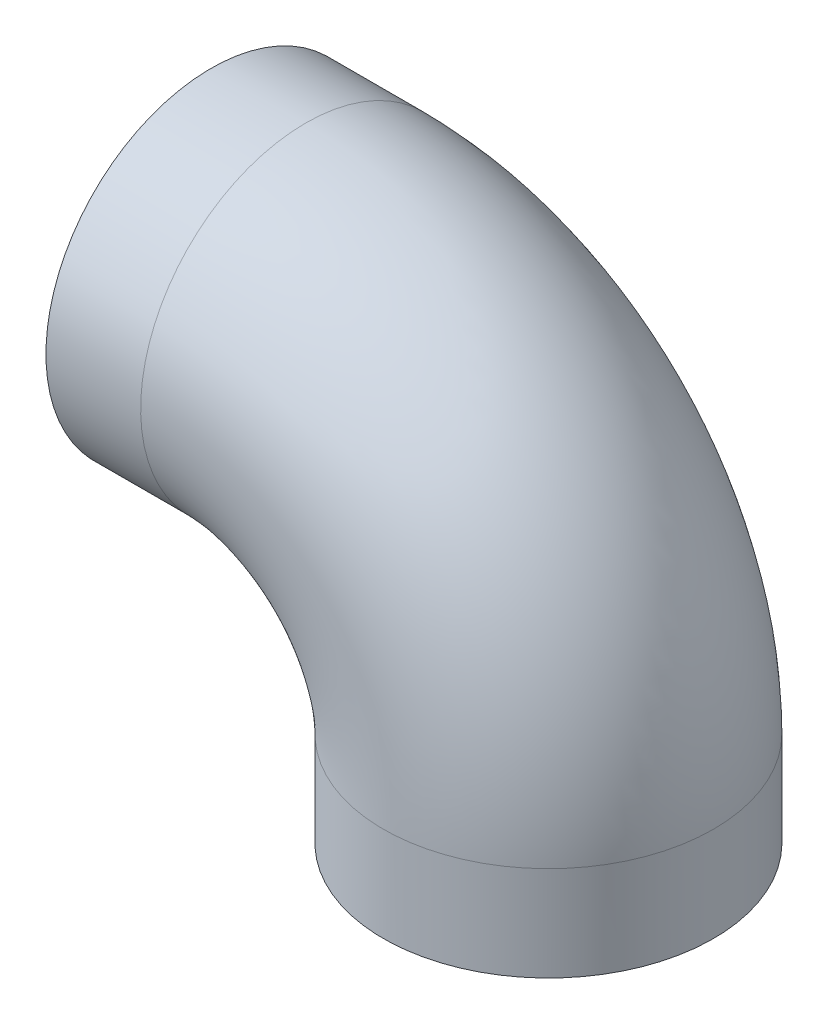
ISO-10303-21;
HEADER;
FILE_DESCRIPTION(('STEP AP214'),'2;1');
FILE_NAME('part.step','',(''),(''),'','','');
FILE_SCHEMA(('AUTOMOTIVE_DESIGN { 1 0 10303 214 1 1 1 1 }'));
ENDSEC;
DATA;
#1=APPLICATION_CONTEXT('core data for automotive mechanical design processes');
#2=APPLICATION_PROTOCOL_DEFINITION('international standard','automotive_design',2000,#1);
#3=PRODUCT_CONTEXT('',#1,'mechanical');
#4=PRODUCT('Part','Part','',(#3));
#5=PRODUCT_RELATED_PRODUCT_CATEGORY('part','',(#4));
#6=PRODUCT_DEFINITION_FORMATION('','',#4);
#7=PRODUCT_DEFINITION_CONTEXT('part definition',#1,'design');
#8=PRODUCT_DEFINITION('design','',#6,#7);
#9=PRODUCT_DEFINITION_SHAPE('','',#8);
#10=(LENGTH_UNIT() NAMED_UNIT(*) SI_UNIT(.MILLI.,.METRE.));
#11=(NAMED_UNIT(*) PLANE_ANGLE_UNIT() SI_UNIT($,.RADIAN.));
#12=(NAMED_UNIT(*) SI_UNIT($,.STERADIAN.) SOLID_ANGLE_UNIT());
#13=UNCERTAINTY_MEASURE_WITH_UNIT(LENGTH_MEASURE(1.E-05),#10,'distance_accuracy_value','');
#14=(GEOMETRIC_REPRESENTATION_CONTEXT(3) GLOBAL_UNCERTAINTY_ASSIGNED_CONTEXT((#13)) GLOBAL_UNIT_ASSIGNED_CONTEXT((#10,
#11,#12)) REPRESENTATION_CONTEXT('',''));
#15=CARTESIAN_POINT('',(0.,0.,0.));
#16=DIRECTION('',(0.,0.,1.));
#17=DIRECTION('',(1.,0.,0.));
#18=AXIS2_PLACEMENT_3D('',#15,#16,#17);
#19=CARTESIAN_POINT('',(0.,0.,0.));
#20=DIRECTION('',(1.,0.,0.));
#21=DIRECTION('',(0.,0.,-1.));
#22=AXIS2_PLACEMENT_3D('',#19,#20,#21);
#23=CYLINDRICAL_SURFACE('',#22,72.5043);
#24=CARTESIAN_POINT('',(50.8,0.,0.));
#25=DIRECTION('',(1.,0.,0.));
#26=DIRECTION('',(0.,0.,-1.));
#27=AXIS2_PLACEMENT_3D('',#24,#25,#26);
#28=CIRCLE('',#27,72.5043);
#29=CARTESIAN_POINT('',(50.8,72.5043,0.));
#30=VERTEX_POINT('',#29);
#31=EDGE_CURVE('E42',#30,#30,#28,.F.);
#32=ORIENTED_EDGE('',*,*,#31,.F.);
#33=EDGE_LOOP('',(#32));
#34=FACE_BOUND('',#33,.T.);
#35=CARTESIAN_POINT('',(44.45,0.,0.));
#36=DIRECTION('',(-1.,0.,0.));
#37=DIRECTION('',(0.,0.,1.));
#38=AXIS2_PLACEMENT_3D('',#35,#36,#37);
#39=CIRCLE('',#38,72.5043);
#40=CARTESIAN_POINT('',(44.45,0.,72.5043));
#41=VERTEX_POINT('',#40);
#42=EDGE_CURVE('E37',#41,#41,#39,.T.);
#43=ORIENTED_EDGE('',*,*,#42,.T.);
#44=EDGE_LOOP('',(#43));
#45=FACE_BOUND('',#44,.T.);
#46=ADVANCED_FACE('F33',(#34,#45),#23,.F.);
#47=CARTESIAN_POINT('',(180.975,-130.175,0.));
#48=DIRECTION('',(0.,-1.,0.));
#49=DIRECTION('',(0.,0.,-1.));
#50=AXIS2_PLACEMENT_3D('',#47,#48,#49);
#51=CYLINDRICAL_SURFACE('',#50,72.5043);
#52=CARTESIAN_POINT('',(180.975,-130.175,0.));
#53=DIRECTION('',(0.,-1.,0.));
#54=DIRECTION('',(0.,0.,-1.));
#55=AXIS2_PLACEMENT_3D('',#52,#53,#54);
#56=CIRCLE('',#55,72.5043);
#57=CARTESIAN_POINT('',(253.4793,-130.175,0.));
#58=VERTEX_POINT('',#57);
#59=EDGE_CURVE('E11',#58,#58,#56,.F.);
#60=ORIENTED_EDGE('',*,*,#59,.T.);
#61=EDGE_LOOP('',(#60));
#62=FACE_BOUND('',#61,.T.);
#63=CARTESIAN_POINT('',(180.975,-136.525,0.));
#64=DIRECTION('',(0.,-1.,0.));
#65=DIRECTION('',(0.,0.,-1.));
#66=AXIS2_PLACEMENT_3D('',#63,#64,#65);
#67=CIRCLE('',#66,72.5043);
#68=CARTESIAN_POINT('',(180.975,-136.525,-72.5043));
#69=VERTEX_POINT('',#68);
#70=EDGE_CURVE('E64',#69,#69,#67,.T.);
#71=ORIENTED_EDGE('',*,*,#70,.T.);
#72=EDGE_LOOP('',(#71));
#73=FACE_BOUND('',#72,.T.);
#74=ADVANCED_FACE('F100',(#62,#73),#51,.F.);
#75=CARTESIAN_POINT('',(0.,0.,0.));
#76=DIRECTION('',(1.,0.,0.));
#77=DIRECTION('',(0.,0.,-1.));
#78=AXIS2_PLACEMENT_3D('',#75,#76,#77);
#79=CYLINDRICAL_SURFACE('',#78,88.5571);
#80=CARTESIAN_POINT('',(50.8,0.,0.));
#81=DIRECTION('',(1.,0.,0.));
#82=DIRECTION('',(0.,0.,-1.));
#83=AXIS2_PLACEMENT_3D('',#80,#81,#82);
#84=CIRCLE('',#83,88.5571);
#85=CARTESIAN_POINT('',(50.8,88.5571,0.));
#86=VERTEX_POINT('',#85);
#87=EDGE_CURVE('E61',#86,#86,#84,.T.);
#88=ORIENTED_EDGE('',*,*,#87,.F.);
#89=EDGE_LOOP('',(#88));
#90=FACE_BOUND('',#89,.T.);
#91=CARTESIAN_POINT('',(0.,0.,0.));
#92=DIRECTION('',(1.,0.,0.));
#93=DIRECTION('',(0.,0.,-1.));
#94=AXIS2_PLACEMENT_3D('',#91,#92,#93);
#95=CIRCLE('',#94,88.5571);
#96=CARTESIAN_POINT('',(0.,0.,-88.5571));
#97=VERTEX_POINT('',#96);
#98=EDGE_CURVE('E48',#97,#97,#95,.T.);
#99=ORIENTED_EDGE('',*,*,#98,.T.);
#100=EDGE_LOOP('',(#99));
#101=FACE_BOUND('',#100,.T.);
#102=ADVANCED_FACE('F106',(#90,#101),#79,.T.);
#103=CARTESIAN_POINT('',(50.8,-130.175,0.));
#104=DIRECTION('',(0.,0.,-1.));
#105=DIRECTION('',(-1.,0.,0.));
#106=AXIS2_PLACEMENT_3D('',#103,#104,#105);
#107=TOROIDAL_SURFACE('',#106,130.175,88.5571);
#108=CARTESIAN_POINT('',(180.975,-130.175,0.));
#109=DIRECTION('',(0.,-1.,0.));
#110=DIRECTION('',(0.,0.,-1.));
#111=AXIS2_PLACEMENT_3D('',#108,#109,#110);
#112=CIRCLE('',#111,88.5571);
#113=CARTESIAN_POINT('',(269.5321,-130.175,0.));
#114=VERTEX_POINT('',#113);
#115=EDGE_CURVE('E58',#114,#114,#112,.T.);
#116=CARTESIAN_POINT('',(50.8,-130.175,0.));
#117=DIRECTION('',(0.,0.,-1.));
#118=DIRECTION('',(-1.,0.,0.));
#119=AXIS2_PLACEMENT_3D('',#116,#117,#118);
#120=CIRCLE('',#119,218.7321);
#121=EDGE_CURVE('',#86,#114,#120,.T.);
#122=ORIENTED_EDGE('',*,*,#87,.T.);
#123=ORIENTED_EDGE('',*,*,#115,.F.);
#124=ORIENTED_EDGE('',*,*,#121,.T.);
#125=ORIENTED_EDGE('',*,*,#121,.F.);
#126=EDGE_LOOP('',(#122,#124,#123,#125));
#127=FACE_BOUND('',#126,.T.);
#128=ADVANCED_FACE('F127',(#127),#107,.T.);
#129=CARTESIAN_POINT('',(180.975,-130.175,0.));
#130=DIRECTION('',(0.,-1.,0.));
#131=DIRECTION('',(0.,0.,-1.));
#132=AXIS2_PLACEMENT_3D('',#129,#130,#131);
#133=CYLINDRICAL_SURFACE('',#132,88.5571);
#134=CARTESIAN_POINT('',(180.975,-180.975,0.));
#135=DIRECTION('',(0.,-1.,0.));
#136=DIRECTION('',(0.,0.,-1.));
#137=AXIS2_PLACEMENT_3D('',#134,#135,#136);
#138=CIRCLE('',#137,88.5571);
#139=CARTESIAN_POINT('',(180.975,-180.975,-88.5571));
#140=VERTEX_POINT('',#139);
#141=EDGE_CURVE('E52',#140,#140,#138,.T.);
#142=ORIENTED_EDGE('',*,*,#141,.F.);
#143=EDGE_LOOP('',(#142));
#144=FACE_BOUND('',#143,.T.);
#145=ORIENTED_EDGE('',*,*,#115,.T.);
#146=EDGE_LOOP('',(#145));
#147=FACE_BOUND('',#146,.T.);
#148=ADVANCED_FACE('F35',(#144,#147),#133,.T.);
#149=CARTESIAN_POINT('',(0.,0.,0.));
#150=DIRECTION('',(1.,0.,0.));
#151=DIRECTION('',(0.,0.,-1.));
#152=AXIS2_PLACEMENT_3D('',#149,#150,#151);
#153=PLANE('',#152);
#154=CARTESIAN_POINT('',(0.,0.,0.));
#155=DIRECTION('',(-1.,0.,0.));
#156=DIRECTION('',(0.,0.,1.));
#157=AXIS2_PLACEMENT_3D('',#154,#155,#156);
#158=CIRCLE('',#157,84.1375);
#159=CARTESIAN_POINT('',(0.,0.,84.1375));
#160=VERTEX_POINT('',#159);
#161=EDGE_CURVE('E78',#160,#160,#158,.T.);
#162=ORIENTED_EDGE('',*,*,#161,.F.);
#163=EDGE_LOOP('',(#162));
#164=FACE_BOUND('',#163,.T.);
#165=ORIENTED_EDGE('',*,*,#98,.F.);
#166=EDGE_LOOP('',(#165));
#167=FACE_BOUND('',#166,.T.);
#168=ADVANCED_FACE('F121',(#164,#167),#153,.F.);
#169=CARTESIAN_POINT('',(180.975,-180.975,0.));
#170=DIRECTION('',(0.,-1.,0.));
#171=DIRECTION('',(0.,0.,-1.));
#172=AXIS2_PLACEMENT_3D('',#169,#170,#171);
#173=PLANE('',#172);
#174=CARTESIAN_POINT('',(180.975,-180.975,0.));
#175=DIRECTION('',(0.,-1.,0.));
#176=DIRECTION('',(0.,0.,-1.));
#177=AXIS2_PLACEMENT_3D('',#174,#175,#176);
#178=CIRCLE('',#177,84.1375);
#179=CARTESIAN_POINT('',(180.975,-180.975,-84.1375));
#180=VERTEX_POINT('',#179);
#181=EDGE_CURVE('E71',#180,#180,#178,.T.);
#182=ORIENTED_EDGE('',*,*,#181,.F.);
#183=EDGE_LOOP('',(#182));
#184=FACE_BOUND('',#183,.T.);
#185=ORIENTED_EDGE('',*,*,#141,.T.);
#186=EDGE_LOOP('',(#185));
#187=FACE_BOUND('',#186,.T.);
#188=ADVANCED_FACE('F116',(#184,#187),#173,.T.);
#189=CARTESIAN_POINT('',(50.8,-130.175,0.));
#190=DIRECTION('',(0.,0.,-1.));
#191=DIRECTION('',(-1.,0.,0.));
#192=AXIS2_PLACEMENT_3D('',#189,#190,#191);
#193=TOROIDAL_SURFACE('',#192,130.175,72.5043);
#194=CARTESIAN_POINT('',(50.8,-130.175,0.));
#195=DIRECTION('',(0.,0.,-1.));
#196=DIRECTION('',(-1.,0.,0.));
#197=AXIS2_PLACEMENT_3D('',#194,#195,#196);
#198=CIRCLE('',#197,202.6793);
#199=EDGE_CURVE('',#30,#58,#198,.T.);
#200=ORIENTED_EDGE('',*,*,#31,.T.);
#201=ORIENTED_EDGE('',*,*,#59,.F.);
#202=ORIENTED_EDGE('',*,*,#199,.T.);
#203=ORIENTED_EDGE('',*,*,#199,.F.);
#204=EDGE_LOOP('',(#200,#202,#201,#203));
#205=FACE_BOUND('',#204,.T.);
#206=ADVANCED_FACE('F109',(#205),#193,.F.);
#207=CARTESIAN_POINT('',(180.975,-136.525,0.));
#208=DIRECTION('',(0.,-1.,0.));
#209=DIRECTION('',(0.,0.,-1.));
#210=AXIS2_PLACEMENT_3D('',#207,#208,#209);
#211=CYLINDRICAL_SURFACE('',#210,84.1375);
#212=CARTESIAN_POINT('',(180.975,-136.525,0.));
#213=DIRECTION('',(0.,-1.,0.));
#214=DIRECTION('',(0.,0.,-1.));
#215=AXIS2_PLACEMENT_3D('',#212,#213,#214);
#216=CIRCLE('',#215,84.1375);
#217=CARTESIAN_POINT('',(180.975,-136.525,-84.1375));
#218=VERTEX_POINT('',#217);
#219=EDGE_CURVE('E67',#218,#218,#216,.T.);
#220=ORIENTED_EDGE('',*,*,#219,.F.);
#221=EDGE_LOOP('',(#220));
#222=FACE_BOUND('',#221,.T.);
#223=ORIENTED_EDGE('',*,*,#181,.T.);
#224=EDGE_LOOP('',(#223));
#225=FACE_BOUND('',#224,.T.);
#226=ADVANCED_FACE('F113',(#222,#225),#211,.F.);
#227=CARTESIAN_POINT('',(180.975,-136.525,0.));
#228=DIRECTION('',(0.,-1.,0.));
#229=DIRECTION('',(0.,0.,-1.));
#230=AXIS2_PLACEMENT_3D('',#227,#228,#229);
#231=PLANE('',#230);
#232=ORIENTED_EDGE('',*,*,#70,.F.);
#233=EDGE_LOOP('',(#232));
#234=FACE_BOUND('',#233,.T.);
#235=ORIENTED_EDGE('',*,*,#219,.T.);
#236=EDGE_LOOP('',(#235));
#237=FACE_BOUND('',#236,.T.);
#238=ADVANCED_FACE('F96',(#234,#237),#231,.T.);
#239=CARTESIAN_POINT('',(44.45,0.,0.));
#240=DIRECTION('',(-1.,0.,0.));
#241=DIRECTION('',(0.,0.,1.));
#242=AXIS2_PLACEMENT_3D('',#239,#240,#241);
#243=CYLINDRICAL_SURFACE('',#242,84.1375);
#244=CARTESIAN_POINT('',(44.45,0.,0.));
#245=DIRECTION('',(-1.,0.,0.));
#246=DIRECTION('',(0.,0.,1.));
#247=AXIS2_PLACEMENT_3D('',#244,#245,#246);
#248=CIRCLE('',#247,84.1375);
#249=CARTESIAN_POINT('',(44.45,0.,84.1375));
#250=VERTEX_POINT('',#249);
#251=EDGE_CURVE('E81',#250,#250,#248,.T.);
#252=ORIENTED_EDGE('',*,*,#251,.F.);
#253=EDGE_LOOP('',(#252));
#254=FACE_BOUND('',#253,.T.);
#255=ORIENTED_EDGE('',*,*,#161,.T.);
#256=EDGE_LOOP('',(#255));
#257=FACE_BOUND('',#256,.T.);
#258=ADVANCED_FACE('F91',(#254,#257),#243,.F.);
#259=CARTESIAN_POINT('',(44.45,0.,0.));
#260=DIRECTION('',(-1.,0.,0.));
#261=DIRECTION('',(0.,0.,1.));
#262=AXIS2_PLACEMENT_3D('',#259,#260,#261);
#263=PLANE('',#262);
#264=ORIENTED_EDGE('',*,*,#42,.F.);
#265=EDGE_LOOP('',(#264));
#266=FACE_BOUND('',#265,.T.);
#267=ORIENTED_EDGE('',*,*,#251,.T.);
#268=EDGE_LOOP('',(#267));
#269=FACE_BOUND('',#268,.T.);
#270=ADVANCED_FACE('F89',(#266,#269),#263,.T.);
#271=CLOSED_SHELL('',(#46,#74,#102,#128,#148,#168,#188,#206,#226,#238,#258,#270));
#272=MANIFOLD_SOLID_BREP('B2',#271);
#273=ADVANCED_BREP_SHAPE_REPRESENTATION('',(#18,#272),#14);
#274=SHAPE_DEFINITION_REPRESENTATION(#9,#273);
ENDSEC;
END-ISO-10303-21;
